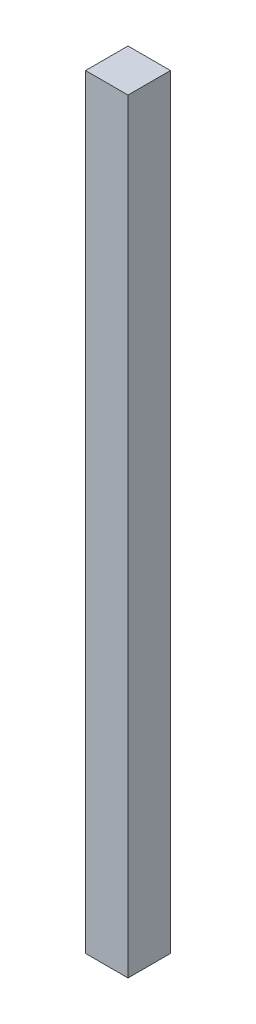
ISO-10303-21;
HEADER;
FILE_DESCRIPTION(('STEP AP214'),'2;1');
FILE_NAME('part.step','',(''),(''),'','','');
FILE_SCHEMA(('AUTOMOTIVE_DESIGN { 1 0 10303 214 1 1 1 1 }'));
ENDSEC;
DATA;
#1=APPLICATION_CONTEXT('core data for automotive mechanical design processes');
#2=APPLICATION_PROTOCOL_DEFINITION('international standard','automotive_design',2000,#1);
#3=PRODUCT_CONTEXT('',#1,'mechanical');
#4=PRODUCT('Part','Part','',(#3));
#5=PRODUCT_RELATED_PRODUCT_CATEGORY('part','',(#4));
#6=PRODUCT_DEFINITION_FORMATION('','',#4);
#7=PRODUCT_DEFINITION_CONTEXT('part definition',#1,'design');
#8=PRODUCT_DEFINITION('design','',#6,#7);
#9=PRODUCT_DEFINITION_SHAPE('','',#8);
#10=(LENGTH_UNIT() NAMED_UNIT(*) SI_UNIT(.MILLI.,.METRE.));
#11=(NAMED_UNIT(*) PLANE_ANGLE_UNIT() SI_UNIT($,.RADIAN.));
#12=(NAMED_UNIT(*) SI_UNIT($,.STERADIAN.) SOLID_ANGLE_UNIT());
#13=UNCERTAINTY_MEASURE_WITH_UNIT(LENGTH_MEASURE(1.E-05),#10,'distance_accuracy_value','');
#14=(GEOMETRIC_REPRESENTATION_CONTEXT(3) GLOBAL_UNCERTAINTY_ASSIGNED_CONTEXT((#13)) GLOBAL_UNIT_ASSIGNED_CONTEXT((#10,
#11,#12)) REPRESENTATION_CONTEXT('',''));
#15=CARTESIAN_POINT('',(0.,0.,0.));
#16=DIRECTION('',(0.,0.,1.));
#17=DIRECTION('',(1.,0.,0.));
#18=AXIS2_PLACEMENT_3D('',#15,#16,#17);
#19=CARTESIAN_POINT('',(0.,-457.2,0.));
#20=DIRECTION('',(-1.,0.,0.));
#21=DIRECTION('',(0.,0.,1.));
#22=AXIS2_PLACEMENT_3D('',#19,#20,#21);
#23=PLANE('',#22);
#24=DIRECTION('',(0.,0.,1.));
#25=VECTOR('',#24,1.);
#26=CARTESIAN_POINT('',(0.,0.,0.));
#27=LINE('',#26,#25);
#28=CARTESIAN_POINT('',(0.,0.,-25.4));
#29=VERTEX_POINT('',#28);
#30=CARTESIAN_POINT('',(0.,0.,0.));
#31=VERTEX_POINT('',#30);
#32=EDGE_CURVE('E112',#29,#31,#27,.T.);
#33=ORIENTED_EDGE('',*,*,#32,.F.);
#34=DIRECTION('',(0.,1.,0.));
#35=VECTOR('',#34,1.);
#36=CARTESIAN_POINT('',(0.,-457.2,-25.4));
#37=LINE('',#36,#35);
#38=CARTESIAN_POINT('',(0.,-457.2,-25.4));
#39=VERTEX_POINT('',#38);
#40=EDGE_CURVE('E11',#39,#29,#37,.T.);
#41=ORIENTED_EDGE('',*,*,#40,.F.);
#42=DIRECTION('',(0.,0.,1.));
#43=VECTOR('',#42,1.);
#44=CARTESIAN_POINT('',(0.,-457.2,0.));
#45=LINE('',#44,#43);
#46=CARTESIAN_POINT('',(0.,-457.2,0.));
#47=VERTEX_POINT('',#46);
#48=EDGE_CURVE('E104',#39,#47,#45,.T.);
#49=ORIENTED_EDGE('',*,*,#48,.T.);
#50=DIRECTION('',(0.,1.,0.));
#51=VECTOR('',#50,1.);
#52=CARTESIAN_POINT('',(0.,-457.2,0.));
#53=LINE('',#52,#51);
#54=EDGE_CURVE('E45',#47,#31,#53,.T.);
#55=ORIENTED_EDGE('',*,*,#54,.T.);
#56=EDGE_LOOP('',(#33,#41,#49,#55));
#57=FACE_BOUND('',#56,.T.);
#58=ADVANCED_FACE('F42',(#57),#23,.T.);
#59=CARTESIAN_POINT('',(0.,-457.2,-25.4));
#60=DIRECTION('',(0.,0.,-1.));
#61=DIRECTION('',(-1.,0.,0.));
#62=AXIS2_PLACEMENT_3D('',#59,#60,#61);
#63=PLANE('',#62);
#64=DIRECTION('',(-1.,0.,0.));
#65=VECTOR('',#64,1.);
#66=CARTESIAN_POINT('',(0.,0.,-25.4));
#67=LINE('',#66,#65);
#68=CARTESIAN_POINT('',(25.4,0.,-25.4));
#69=VERTEX_POINT('',#68);
#70=EDGE_CURVE('E107',#69,#29,#67,.T.);
#71=ORIENTED_EDGE('',*,*,#70,.F.);
#72=DIRECTION('',(0.,1.,0.));
#73=VECTOR('',#72,1.);
#74=CARTESIAN_POINT('',(25.4,-457.2,-25.4));
#75=LINE('',#74,#73);
#76=CARTESIAN_POINT('',(25.4,-457.2,-25.4));
#77=VERTEX_POINT('',#76);
#78=EDGE_CURVE('E52',#77,#69,#75,.T.);
#79=ORIENTED_EDGE('',*,*,#78,.F.);
#80=DIRECTION('',(-1.,0.,0.));
#81=VECTOR('',#80,1.);
#82=CARTESIAN_POINT('',(0.,-457.2,-25.4));
#83=LINE('',#82,#81);
#84=EDGE_CURVE('E99',#77,#39,#83,.T.);
#85=ORIENTED_EDGE('',*,*,#84,.T.);
#86=ORIENTED_EDGE('',*,*,#40,.T.);
#87=EDGE_LOOP('',(#71,#79,#85,#86));
#88=FACE_BOUND('',#87,.T.);
#89=ADVANCED_FACE('F128',(#88),#63,.T.);
#90=CARTESIAN_POINT('',(25.4,-457.2,0.));
#91=DIRECTION('',(1.,0.,0.));
#92=DIRECTION('',(0.,0.,-1.));
#93=AXIS2_PLACEMENT_3D('',#90,#91,#92);
#94=PLANE('',#93);
#95=DIRECTION('',(0.,0.,-1.));
#96=VECTOR('',#95,1.);
#97=CARTESIAN_POINT('',(25.4,0.,0.));
#98=LINE('',#97,#96);
#99=CARTESIAN_POINT('',(25.4,0.,0.));
#100=VERTEX_POINT('',#99);
#101=EDGE_CURVE('E93',#100,#69,#98,.T.);
#102=ORIENTED_EDGE('',*,*,#101,.F.);
#103=DIRECTION('',(0.,1.,0.));
#104=VECTOR('',#103,1.);
#105=CARTESIAN_POINT('',(25.4,-457.2,0.));
#106=LINE('',#105,#104);
#107=CARTESIAN_POINT('',(25.4,-457.2,0.));
#108=VERTEX_POINT('',#107);
#109=EDGE_CURVE('E88',#108,#100,#106,.T.);
#110=ORIENTED_EDGE('',*,*,#109,.F.);
#111=DIRECTION('',(0.,0.,-1.));
#112=VECTOR('',#111,1.);
#113=CARTESIAN_POINT('',(25.4,-457.2,0.));
#114=LINE('',#113,#112);
#115=EDGE_CURVE('E91',#108,#77,#114,.T.);
#116=ORIENTED_EDGE('',*,*,#115,.T.);
#117=ORIENTED_EDGE('',*,*,#78,.T.);
#118=EDGE_LOOP('',(#102,#110,#116,#117));
#119=FACE_BOUND('',#118,.T.);
#120=ADVANCED_FACE('F90',(#119),#94,.T.);
#121=CARTESIAN_POINT('',(0.,-457.2,0.));
#122=DIRECTION('',(0.,0.,1.));
#123=DIRECTION('',(1.,0.,0.));
#124=AXIS2_PLACEMENT_3D('',#121,#122,#123);
#125=PLANE('',#124);
#126=DIRECTION('',(1.,0.,0.));
#127=VECTOR('',#126,1.);
#128=CARTESIAN_POINT('',(0.,0.,0.));
#129=LINE('',#128,#127);
#130=EDGE_CURVE('E116',#31,#100,#129,.T.);
#131=ORIENTED_EDGE('',*,*,#130,.F.);
#132=ORIENTED_EDGE('',*,*,#54,.F.);
#133=DIRECTION('',(1.,0.,0.));
#134=VECTOR('',#133,1.);
#135=CARTESIAN_POINT('',(0.,-457.2,0.));
#136=LINE('',#135,#134);
#137=EDGE_CURVE('E98',#47,#108,#136,.T.);
#138=ORIENTED_EDGE('',*,*,#137,.T.);
#139=ORIENTED_EDGE('',*,*,#109,.T.);
#140=EDGE_LOOP('',(#131,#132,#138,#139));
#141=FACE_BOUND('',#140,.T.);
#142=ADVANCED_FACE('F102',(#141),#125,.T.);
#143=CARTESIAN_POINT('',(0.,-457.2,0.));
#144=DIRECTION('',(0.,-1.,0.));
#145=DIRECTION('',(0.,0.,-1.));
#146=AXIS2_PLACEMENT_3D('',#143,#144,#145);
#147=PLANE('',#146);
#148=ORIENTED_EDGE('',*,*,#48,.F.);
#149=ORIENTED_EDGE('',*,*,#84,.F.);
#150=ORIENTED_EDGE('',*,*,#115,.F.);
#151=ORIENTED_EDGE('',*,*,#137,.F.);
#152=EDGE_LOOP('',(#148,#149,#150,#151));
#153=FACE_BOUND('',#152,.T.);
#154=ADVANCED_FACE('F97',(#153),#147,.T.);
#155=CARTESIAN_POINT('',(0.,0.,0.));
#156=DIRECTION('',(0.,-1.,0.));
#157=DIRECTION('',(0.,0.,-1.));
#158=AXIS2_PLACEMENT_3D('',#155,#156,#157);
#159=PLANE('',#158);
#160=ORIENTED_EDGE('',*,*,#32,.T.);
#161=ORIENTED_EDGE('',*,*,#130,.T.);
#162=ORIENTED_EDGE('',*,*,#101,.T.);
#163=ORIENTED_EDGE('',*,*,#70,.T.);
#164=EDGE_LOOP('',(#160,#161,#162,#163));
#165=FACE_BOUND('',#164,.T.);
#166=ADVANCED_FACE('F127',(#165),#159,.F.);
#167=CLOSED_SHELL('',(#58,#89,#120,#142,#154,#166));
#168=MANIFOLD_SOLID_BREP('B2',#167);
#169=ADVANCED_BREP_SHAPE_REPRESENTATION('',(#18,#168),#14);
#170=SHAPE_DEFINITION_REPRESENTATION(#9,#169);
ENDSEC;
END-ISO-10303-21;
